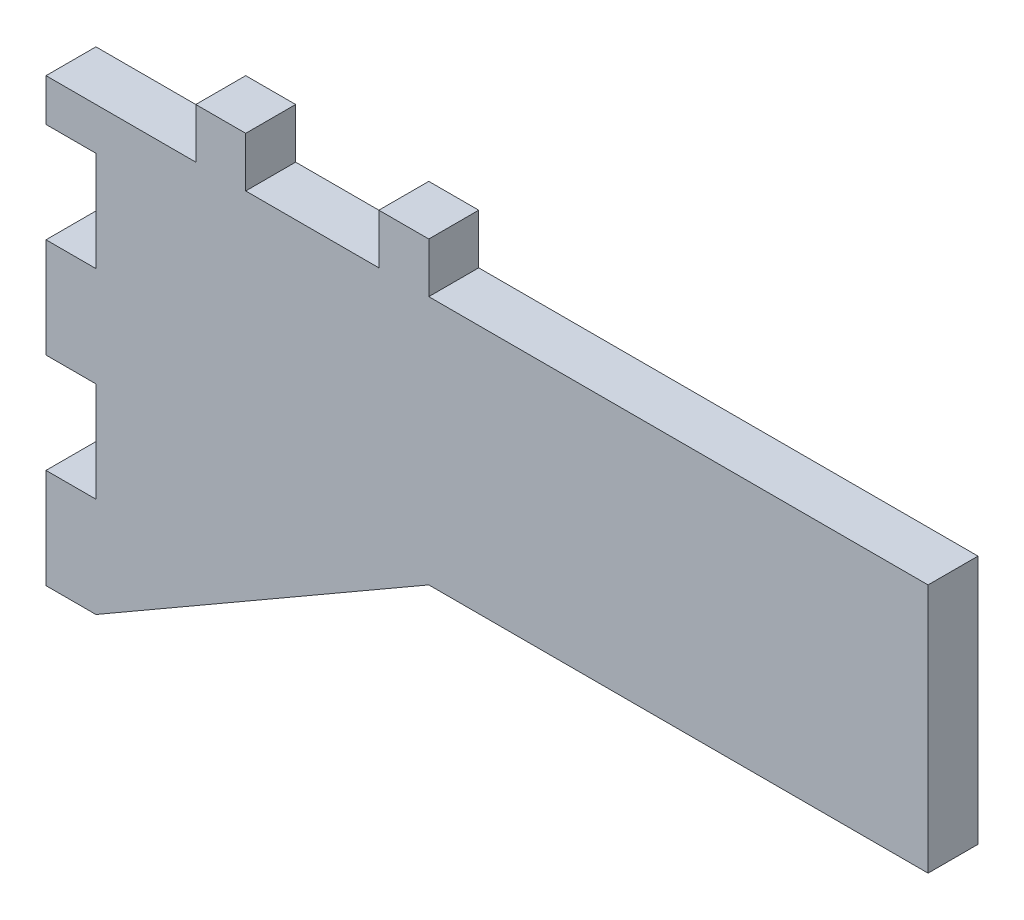
ISO-10303-21;
HEADER;
FILE_DESCRIPTION(('STEP AP214'),'2;1');
FILE_NAME('part.step','',(''),(''),'','','');
FILE_SCHEMA(('AUTOMOTIVE_DESIGN { 1 0 10303 214 1 1 1 1 }'));
ENDSEC;
DATA;
#1=APPLICATION_CONTEXT('core data for automotive mechanical design processes');
#2=APPLICATION_PROTOCOL_DEFINITION('international standard','automotive_design',2000,#1);
#3=PRODUCT_CONTEXT('',#1,'mechanical');
#4=PRODUCT('Part','Part','',(#3));
#5=PRODUCT_RELATED_PRODUCT_CATEGORY('part','',(#4));
#6=PRODUCT_DEFINITION_FORMATION('','',#4);
#7=PRODUCT_DEFINITION_CONTEXT('part definition',#1,'design');
#8=PRODUCT_DEFINITION('design','',#6,#7);
#9=PRODUCT_DEFINITION_SHAPE('','',#8);
#10=(LENGTH_UNIT() NAMED_UNIT(*) SI_UNIT(.MILLI.,.METRE.));
#11=(NAMED_UNIT(*) PLANE_ANGLE_UNIT() SI_UNIT($,.RADIAN.));
#12=(NAMED_UNIT(*) SI_UNIT($,.STERADIAN.) SOLID_ANGLE_UNIT());
#13=UNCERTAINTY_MEASURE_WITH_UNIT(LENGTH_MEASURE(1.E-05),#10,'distance_accuracy_value','');
#14=(GEOMETRIC_REPRESENTATION_CONTEXT(3) GLOBAL_UNCERTAINTY_ASSIGNED_CONTEXT((#13)) GLOBAL_UNIT_ASSIGNED_CONTEXT((#10,
#11,#12)) REPRESENTATION_CONTEXT('',''));
#15=CARTESIAN_POINT('',(0.,0.,0.));
#16=DIRECTION('',(0.,0.,1.));
#17=DIRECTION('',(1.,0.,0.));
#18=AXIS2_PLACEMENT_3D('',#15,#16,#17);
#19=CARTESIAN_POINT('',(-20.,0.,3.));
#20=DIRECTION('',(1.,0.,0.));
#21=DIRECTION('',(0.,1.,0.));
#22=AXIS2_PLACEMENT_3D('',#19,#20,#21);
#23=PLANE('',#22);
#24=DIRECTION('',(0.,0.,1.));
#25=VECTOR('',#24,1.);
#26=CARTESIAN_POINT('',(-20.,-2.54,0.));
#27=LINE('',#26,#25);
#28=CARTESIAN_POINT('',(-20.,-2.54,0.));
#29=VERTEX_POINT('',#28);
#30=CARTESIAN_POINT('',(-20.,-2.54,3.));
#31=VERTEX_POINT('',#30);
#32=EDGE_CURVE('E237',#29,#31,#27,.T.);
#33=ORIENTED_EDGE('',*,*,#32,.F.);
#34=DIRECTION('',(0.,-1.,0.));
#35=VECTOR('',#34,1.);
#36=CARTESIAN_POINT('',(-20.,0.,0.));
#37=LINE('',#36,#35);
#38=CARTESIAN_POINT('',(-20.,-8.54,0.));
#39=VERTEX_POINT('',#38);
#40=EDGE_CURVE('E374',#29,#39,#37,.T.);
#41=ORIENTED_EDGE('',*,*,#40,.T.);
#42=DIRECTION('',(0.,0.,1.));
#43=VECTOR('',#42,1.);
#44=CARTESIAN_POINT('',(-20.,-8.54,0.));
#45=LINE('',#44,#43);
#46=CARTESIAN_POINT('',(-20.,-8.54,3.));
#47=VERTEX_POINT('',#46);
#48=EDGE_CURVE('E244',#39,#47,#45,.T.);
#49=ORIENTED_EDGE('',*,*,#48,.T.);
#50=DIRECTION('',(0.,-1.,0.));
#51=VECTOR('',#50,1.);
#52=CARTESIAN_POINT('',(-20.,0.,3.));
#53=LINE('',#52,#51);
#54=EDGE_CURVE('E337',#31,#47,#53,.T.);
#55=ORIENTED_EDGE('',*,*,#54,.F.);
#56=EDGE_LOOP('',(#33,#41,#49,#55));
#57=FACE_BOUND('',#56,.T.);
#58=ADVANCED_FACE('F45',(#57),#23,.F.);
#59=DIRECTION('',(0.,0.,1.));
#60=VECTOR('',#59,1.);
#61=CARTESIAN_POINT('',(-20.,-14.54,0.));
#62=LINE('',#61,#60);
#63=CARTESIAN_POINT('',(-20.,-14.54,0.));
#64=VERTEX_POINT('',#63);
#65=CARTESIAN_POINT('',(-20.,-14.54,3.));
#66=VERTEX_POINT('',#65);
#67=EDGE_CURVE('E254',#64,#66,#62,.T.);
#68=ORIENTED_EDGE('',*,*,#67,.F.);
#69=CARTESIAN_POINT('',(-20.,-20.54,0.));
#70=VERTEX_POINT('',#69);
#71=EDGE_CURVE('E208',#64,#70,#37,.T.);
#72=ORIENTED_EDGE('',*,*,#71,.T.);
#73=DIRECTION('',(0.,0.,1.));
#74=VECTOR('',#73,1.);
#75=CARTESIAN_POINT('',(-20.,-20.54,0.));
#76=LINE('',#75,#74);
#77=CARTESIAN_POINT('',(-20.,-20.54,3.));
#78=VERTEX_POINT('',#77);
#79=EDGE_CURVE('E277',#70,#78,#76,.T.);
#80=ORIENTED_EDGE('',*,*,#79,.T.);
#81=EDGE_CURVE('E333',#66,#78,#53,.T.);
#82=ORIENTED_EDGE('',*,*,#81,.F.);
#83=EDGE_LOOP('',(#68,#72,#80,#82));
#84=FACE_BOUND('',#83,.T.);
#85=ADVANCED_FACE('F484',(#84),#23,.F.);
#86=CARTESIAN_POINT('',(0.,0.,3.));
#87=DIRECTION('',(-1.,0.,0.));
#88=DIRECTION('',(0.,0.,1.));
#89=AXIS2_PLACEMENT_3D('',#86,#87,#88);
#90=PLANE('',#89);
#91=DIRECTION('',(0.,1.,0.));
#92=VECTOR('',#91,1.);
#93=CARTESIAN_POINT('',(0.,0.,0.));
#94=LINE('',#93,#92);
#95=CARTESIAN_POINT('',(0.,0.,0.));
#96=VERTEX_POINT('',#95);
#97=CARTESIAN_POINT('',(0.,3.,0.));
#98=VERTEX_POINT('',#97);
#99=EDGE_CURVE('E241',#96,#98,#94,.T.);
#100=ORIENTED_EDGE('',*,*,#99,.T.);
#101=DIRECTION('',(0.,0.,-1.));
#102=VECTOR('',#101,1.);
#103=CARTESIAN_POINT('',(0.,3.,3.));
#104=LINE('',#103,#102);
#105=CARTESIAN_POINT('',(0.,3.,3.));
#106=VERTEX_POINT('',#105);
#107=EDGE_CURVE('E11',#106,#98,#104,.T.);
#108=ORIENTED_EDGE('',*,*,#107,.F.);
#109=DIRECTION('',(0.,1.,0.));
#110=VECTOR('',#109,1.);
#111=CARTESIAN_POINT('',(0.,0.,3.));
#112=LINE('',#111,#110);
#113=CARTESIAN_POINT('',(0.,0.,3.));
#114=VERTEX_POINT('',#113);
#115=EDGE_CURVE('E307',#114,#106,#112,.T.);
#116=ORIENTED_EDGE('',*,*,#115,.F.);
#117=DIRECTION('',(0.,0.,-1.));
#118=VECTOR('',#117,1.);
#119=CARTESIAN_POINT('',(0.,0.,3.));
#120=LINE('',#119,#118);
#121=EDGE_CURVE('E350',#114,#96,#120,.T.);
#122=ORIENTED_EDGE('',*,*,#121,.T.);
#123=EDGE_LOOP('',(#100,#108,#116,#122));
#124=FACE_BOUND('',#123,.T.);
#125=ADVANCED_FACE('F47',(#124),#90,.F.);
#126=CARTESIAN_POINT('',(0.,3.,3.));
#127=DIRECTION('',(0.,-1.,0.));
#128=DIRECTION('',(1.,0.,0.));
#129=AXIS2_PLACEMENT_3D('',#126,#127,#128);
#130=PLANE('',#129);
#131=DIRECTION('',(-1.,0.,0.));
#132=VECTOR('',#131,1.);
#133=CARTESIAN_POINT('',(0.,3.,0.));
#134=LINE('',#133,#132);
#135=CARTESIAN_POINT('',(-3.,3.,0.));
#136=VERTEX_POINT('',#135);
#137=EDGE_CURVE('E354',#98,#136,#134,.T.);
#138=ORIENTED_EDGE('',*,*,#137,.T.);
#139=DIRECTION('',(0.,0.,-1.));
#140=VECTOR('',#139,1.);
#141=CARTESIAN_POINT('',(-3.,3.,3.));
#142=LINE('',#141,#140);
#143=CARTESIAN_POINT('',(-3.,3.,3.));
#144=VERTEX_POINT('',#143);
#145=EDGE_CURVE('E54',#144,#136,#142,.T.);
#146=ORIENTED_EDGE('',*,*,#145,.F.);
#147=DIRECTION('',(-1.,0.,0.));
#148=VECTOR('',#147,1.);
#149=CARTESIAN_POINT('',(0.,3.,3.));
#150=LINE('',#149,#148);
#151=EDGE_CURVE('E311',#106,#144,#150,.T.);
#152=ORIENTED_EDGE('',*,*,#151,.F.);
#153=ORIENTED_EDGE('',*,*,#107,.T.);
#154=EDGE_LOOP('',(#138,#146,#152,#153));
#155=FACE_BOUND('',#154,.T.);
#156=ADVANCED_FACE('F448',(#155),#130,.F.);
#157=CARTESIAN_POINT('',(-3.,0.,3.));
#158=DIRECTION('',(1.,0.,0.));
#159=DIRECTION('',(0.,0.,-1.));
#160=AXIS2_PLACEMENT_3D('',#157,#158,#159);
#161=PLANE('',#160);
#162=DIRECTION('',(0.,-1.,0.));
#163=VECTOR('',#162,1.);
#164=CARTESIAN_POINT('',(-3.,0.,0.));
#165=LINE('',#164,#163);
#166=CARTESIAN_POINT('',(-3.,0.,0.));
#167=VERTEX_POINT('',#166);
#168=EDGE_CURVE('E357',#136,#167,#165,.T.);
#169=ORIENTED_EDGE('',*,*,#168,.T.);
#170=DIRECTION('',(0.,0.,-1.));
#171=VECTOR('',#170,1.);
#172=CARTESIAN_POINT('',(-3.,0.,3.));
#173=LINE('',#172,#171);
#174=CARTESIAN_POINT('',(-3.,0.,3.));
#175=VERTEX_POINT('',#174);
#176=EDGE_CURVE('E419',#175,#167,#173,.T.);
#177=ORIENTED_EDGE('',*,*,#176,.F.);
#178=DIRECTION('',(0.,-1.,0.));
#179=VECTOR('',#178,1.);
#180=CARTESIAN_POINT('',(-3.,0.,3.));
#181=LINE('',#180,#179);
#182=EDGE_CURVE('E315',#144,#175,#181,.T.);
#183=ORIENTED_EDGE('',*,*,#182,.F.);
#184=ORIENTED_EDGE('',*,*,#145,.T.);
#185=EDGE_LOOP('',(#169,#177,#183,#184));
#186=FACE_BOUND('',#185,.T.);
#187=ADVANCED_FACE('F428',(#186),#161,.F.);
#188=CARTESIAN_POINT('',(-3.,0.,3.));
#189=DIRECTION('',(0.,-1.,0.));
#190=DIRECTION('',(1.,0.,0.));
#191=AXIS2_PLACEMENT_3D('',#188,#189,#190);
#192=PLANE('',#191);
#193=DIRECTION('',(-1.,0.,0.));
#194=VECTOR('',#193,1.);
#195=CARTESIAN_POINT('',(-3.,0.,0.));
#196=LINE('',#195,#194);
#197=CARTESIAN_POINT('',(-11.,0.,0.));
#198=VERTEX_POINT('',#197);
#199=EDGE_CURVE('E360',#167,#198,#196,.T.);
#200=ORIENTED_EDGE('',*,*,#199,.T.);
#201=DIRECTION('',(0.,0.,-1.));
#202=VECTOR('',#201,1.);
#203=CARTESIAN_POINT('',(-11.,0.,3.));
#204=LINE('',#203,#202);
#205=CARTESIAN_POINT('',(-11.,0.,3.));
#206=VERTEX_POINT('',#205);
#207=EDGE_CURVE('E415',#206,#198,#204,.T.);
#208=ORIENTED_EDGE('',*,*,#207,.F.);
#209=DIRECTION('',(-1.,0.,0.));
#210=VECTOR('',#209,1.);
#211=CARTESIAN_POINT('',(-3.,0.,3.));
#212=LINE('',#211,#210);
#213=EDGE_CURVE('E318',#175,#206,#212,.T.);
#214=ORIENTED_EDGE('',*,*,#213,.F.);
#215=ORIENTED_EDGE('',*,*,#176,.T.);
#216=EDGE_LOOP('',(#200,#208,#214,#215));
#217=FACE_BOUND('',#216,.T.);
#218=ADVANCED_FACE('F436',(#217),#192,.F.);
#219=CARTESIAN_POINT('',(-11.,0.,3.));
#220=DIRECTION('',(-1.,0.,0.));
#221=DIRECTION('',(0.,0.,1.));
#222=AXIS2_PLACEMENT_3D('',#219,#220,#221);
#223=PLANE('',#222);
#224=DIRECTION('',(0.,1.,0.));
#225=VECTOR('',#224,1.);
#226=CARTESIAN_POINT('',(-11.,0.,0.));
#227=LINE('',#226,#225);
#228=CARTESIAN_POINT('',(-11.,3.,0.));
#229=VERTEX_POINT('',#228);
#230=EDGE_CURVE('E363',#198,#229,#227,.T.);
#231=ORIENTED_EDGE('',*,*,#230,.T.);
#232=DIRECTION('',(0.,0.,-1.));
#233=VECTOR('',#232,1.);
#234=CARTESIAN_POINT('',(-11.,3.,3.));
#235=LINE('',#234,#233);
#236=CARTESIAN_POINT('',(-11.,3.,3.));
#237=VERTEX_POINT('',#236);
#238=EDGE_CURVE('E411',#237,#229,#235,.T.);
#239=ORIENTED_EDGE('',*,*,#238,.F.);
#240=DIRECTION('',(0.,1.,0.));
#241=VECTOR('',#240,1.);
#242=CARTESIAN_POINT('',(-11.,0.,3.));
#243=LINE('',#242,#241);
#244=EDGE_CURVE('E321',#206,#237,#243,.T.);
#245=ORIENTED_EDGE('',*,*,#244,.F.);
#246=ORIENTED_EDGE('',*,*,#207,.T.);
#247=EDGE_LOOP('',(#231,#239,#245,#246));
#248=FACE_BOUND('',#247,.T.);
#249=ADVANCED_FACE('F440',(#248),#223,.F.);
#250=CARTESIAN_POINT('',(-11.,3.,3.));
#251=DIRECTION('',(0.,-1.,0.));
#252=DIRECTION('',(1.,0.,0.));
#253=AXIS2_PLACEMENT_3D('',#250,#251,#252);
#254=PLANE('',#253);
#255=DIRECTION('',(-1.,0.,0.));
#256=VECTOR('',#255,1.);
#257=CARTESIAN_POINT('',(-11.,3.,0.));
#258=LINE('',#257,#256);
#259=CARTESIAN_POINT('',(-14.,3.,0.));
#260=VERTEX_POINT('',#259);
#261=EDGE_CURVE('E366',#229,#260,#258,.T.);
#262=ORIENTED_EDGE('',*,*,#261,.T.);
#263=DIRECTION('',(0.,0.,-1.));
#264=VECTOR('',#263,1.);
#265=CARTESIAN_POINT('',(-14.,3.,3.));
#266=LINE('',#265,#264);
#267=CARTESIAN_POINT('',(-14.,3.,3.));
#268=VERTEX_POINT('',#267);
#269=EDGE_CURVE('E407',#268,#260,#266,.T.);
#270=ORIENTED_EDGE('',*,*,#269,.F.);
#271=DIRECTION('',(-1.,0.,0.));
#272=VECTOR('',#271,1.);
#273=CARTESIAN_POINT('',(-11.,3.,3.));
#274=LINE('',#273,#272);
#275=EDGE_CURVE('E324',#237,#268,#274,.T.);
#276=ORIENTED_EDGE('',*,*,#275,.F.);
#277=ORIENTED_EDGE('',*,*,#238,.T.);
#278=EDGE_LOOP('',(#262,#270,#276,#277));
#279=FACE_BOUND('',#278,.T.);
#280=ADVANCED_FACE('F525',(#279),#254,.F.);
#281=CARTESIAN_POINT('',(-14.,0.,3.));
#282=DIRECTION('',(1.,0.,0.));
#283=DIRECTION('',(0.,0.,-1.));
#284=AXIS2_PLACEMENT_3D('',#281,#282,#283);
#285=PLANE('',#284);
#286=DIRECTION('',(0.,-1.,0.));
#287=VECTOR('',#286,1.);
#288=CARTESIAN_POINT('',(-14.,0.,0.));
#289=LINE('',#288,#287);
#290=CARTESIAN_POINT('',(-14.,0.,0.));
#291=VERTEX_POINT('',#290);
#292=EDGE_CURVE('E209',#260,#291,#289,.T.);
#293=ORIENTED_EDGE('',*,*,#292,.T.);
#294=DIRECTION('',(0.,0.,-1.));
#295=VECTOR('',#294,1.);
#296=CARTESIAN_POINT('',(-14.,0.,3.));
#297=LINE('',#296,#295);
#298=CARTESIAN_POINT('',(-14.,0.,3.));
#299=VERTEX_POINT('',#298);
#300=EDGE_CURVE('E203',#299,#291,#297,.T.);
#301=ORIENTED_EDGE('',*,*,#300,.F.);
#302=DIRECTION('',(0.,-1.,0.));
#303=VECTOR('',#302,1.);
#304=CARTESIAN_POINT('',(-14.,0.,3.));
#305=LINE('',#304,#303);
#306=EDGE_CURVE('E327',#268,#299,#305,.T.);
#307=ORIENTED_EDGE('',*,*,#306,.F.);
#308=ORIENTED_EDGE('',*,*,#269,.T.);
#309=EDGE_LOOP('',(#293,#301,#307,#308));
#310=FACE_BOUND('',#309,.T.);
#311=ADVANCED_FACE('F522',(#310),#285,.F.);
#312=CARTESIAN_POINT('',(-14.,0.,3.));
#313=DIRECTION('',(0.,-1.,0.));
#314=DIRECTION('',(1.,0.,0.));
#315=AXIS2_PLACEMENT_3D('',#312,#313,#314);
#316=PLANE('',#315);
#317=DIRECTION('',(-1.,0.,0.));
#318=VECTOR('',#317,1.);
#319=CARTESIAN_POINT('',(-14.,0.,0.));
#320=LINE('',#319,#318);
#321=CARTESIAN_POINT('',(-23.,0.,0.));
#322=VERTEX_POINT('',#321);
#323=EDGE_CURVE('E196',#291,#322,#320,.T.);
#324=ORIENTED_EDGE('',*,*,#323,.T.);
#325=DIRECTION('',(0.,0.,1.));
#326=VECTOR('',#325,1.);
#327=CARTESIAN_POINT('',(-23.,0.,0.));
#328=LINE('',#327,#326);
#329=CARTESIAN_POINT('',(-23.,0.,3.));
#330=VERTEX_POINT('',#329);
#331=EDGE_CURVE('E200',#322,#330,#328,.T.);
#332=ORIENTED_EDGE('',*,*,#331,.T.);
#333=DIRECTION('',(-1.,0.,0.));
#334=VECTOR('',#333,1.);
#335=CARTESIAN_POINT('',(-14.,0.,3.));
#336=LINE('',#335,#334);
#337=EDGE_CURVE('E330',#299,#330,#336,.T.);
#338=ORIENTED_EDGE('',*,*,#337,.F.);
#339=ORIENTED_EDGE('',*,*,#300,.T.);
#340=EDGE_LOOP('',(#324,#332,#338,#339));
#341=FACE_BOUND('',#340,.T.);
#342=ADVANCED_FACE('F198',(#341),#316,.F.);
#343=CARTESIAN_POINT('',(-20.,-26.54,3.));
#344=DIRECTION('',(-0.499772441725888,0.866156744758905,0.));
#345=DIRECTION('',(-0.866156744758905,-0.499772441725888,0.));
#346=AXIS2_PLACEMENT_3D('',#343,#344,#345);
#347=PLANE('',#346);
#348=DIRECTION('',(0.866156744758905,0.499772441725888,0.));
#349=VECTOR('',#348,1.);
#350=CARTESIAN_POINT('',(-20.,-26.54,0.));
#351=LINE('',#350,#349);
#352=CARTESIAN_POINT('',(-20.,-26.54,0.));
#353=VERTEX_POINT('',#352);
#354=CARTESIAN_POINT('',(0.,-15.,0.));
#355=VERTEX_POINT('',#354);
#356=EDGE_CURVE('E375',#353,#355,#351,.T.);
#357=ORIENTED_EDGE('',*,*,#356,.T.);
#358=DIRECTION('',(0.,0.,-1.));
#359=VECTOR('',#358,1.);
#360=CARTESIAN_POINT('',(0.,-15.,3.));
#361=LINE('',#360,#359);
#362=CARTESIAN_POINT('',(0.,-15.,3.));
#363=VERTEX_POINT('',#362);
#364=EDGE_CURVE('E397',#363,#355,#361,.T.);
#365=ORIENTED_EDGE('',*,*,#364,.F.);
#366=DIRECTION('',(0.866156744758905,0.499772441725888,0.));
#367=VECTOR('',#366,1.);
#368=CARTESIAN_POINT('',(-20.,-26.54,3.));
#369=LINE('',#368,#367);
#370=CARTESIAN_POINT('',(-20.,-26.54,3.));
#371=VERTEX_POINT('',#370);
#372=EDGE_CURVE('E338',#371,#363,#369,.T.);
#373=ORIENTED_EDGE('',*,*,#372,.F.);
#374=DIRECTION('',(0.,0.,-1.));
#375=VECTOR('',#374,1.);
#376=CARTESIAN_POINT('',(-20.,-26.54,3.));
#377=LINE('',#376,#375);
#378=EDGE_CURVE('E401',#371,#353,#377,.T.);
#379=ORIENTED_EDGE('',*,*,#378,.T.);
#380=EDGE_LOOP('',(#357,#365,#373,#379));
#381=FACE_BOUND('',#380,.T.);
#382=ADVANCED_FACE('F470',(#381),#347,.F.);
#383=CARTESIAN_POINT('',(0.,-15.,3.));
#384=DIRECTION('',(0.,1.,0.));
#385=DIRECTION('',(0.,0.,1.));
#386=AXIS2_PLACEMENT_3D('',#383,#384,#385);
#387=PLANE('',#386);
#388=DIRECTION('',(1.,0.,0.));
#389=VECTOR('',#388,1.);
#390=CARTESIAN_POINT('',(0.,-15.,0.));
#391=LINE('',#390,#389);
#392=CARTESIAN_POINT('',(30.,-15.,0.));
#393=VERTEX_POINT('',#392);
#394=EDGE_CURVE('E378',#355,#393,#391,.T.);
#395=ORIENTED_EDGE('',*,*,#394,.T.);
#396=DIRECTION('',(0.,0.,-1.));
#397=VECTOR('',#396,1.);
#398=CARTESIAN_POINT('',(30.,-15.,3.));
#399=LINE('',#398,#397);
#400=CARTESIAN_POINT('',(30.,-15.,3.));
#401=VERTEX_POINT('',#400);
#402=EDGE_CURVE('E393',#401,#393,#399,.T.);
#403=ORIENTED_EDGE('',*,*,#402,.F.);
#404=DIRECTION('',(1.,0.,0.));
#405=VECTOR('',#404,1.);
#406=CARTESIAN_POINT('',(0.,-15.,3.));
#407=LINE('',#406,#405);
#408=EDGE_CURVE('E341',#363,#401,#407,.T.);
#409=ORIENTED_EDGE('',*,*,#408,.F.);
#410=ORIENTED_EDGE('',*,*,#364,.T.);
#411=EDGE_LOOP('',(#395,#403,#409,#410));
#412=FACE_BOUND('',#411,.T.);
#413=ADVANCED_FACE('F464',(#412),#387,.F.);
#414=CARTESIAN_POINT('',(30.,0.,3.));
#415=DIRECTION('',(-1.,0.,0.));
#416=DIRECTION('',(0.,-1.,0.));
#417=AXIS2_PLACEMENT_3D('',#414,#415,#416);
#418=PLANE('',#417);
#419=DIRECTION('',(0.,1.,0.));
#420=VECTOR('',#419,1.);
#421=CARTESIAN_POINT('',(30.,0.,0.));
#422=LINE('',#421,#420);
#423=CARTESIAN_POINT('',(30.,0.,0.));
#424=VERTEX_POINT('',#423);
#425=EDGE_CURVE('E381',#393,#424,#422,.T.);
#426=ORIENTED_EDGE('',*,*,#425,.T.);
#427=DIRECTION('',(0.,0.,-1.));
#428=VECTOR('',#427,1.);
#429=CARTESIAN_POINT('',(30.,0.,3.));
#430=LINE('',#429,#428);
#431=CARTESIAN_POINT('',(30.,0.,3.));
#432=VERTEX_POINT('',#431);
#433=EDGE_CURVE('E389',#432,#424,#430,.T.);
#434=ORIENTED_EDGE('',*,*,#433,.F.);
#435=DIRECTION('',(0.,1.,0.));
#436=VECTOR('',#435,1.);
#437=CARTESIAN_POINT('',(30.,0.,3.));
#438=LINE('',#437,#436);
#439=EDGE_CURVE('E344',#401,#432,#438,.T.);
#440=ORIENTED_EDGE('',*,*,#439,.F.);
#441=ORIENTED_EDGE('',*,*,#402,.T.);
#442=EDGE_LOOP('',(#426,#434,#440,#441));
#443=FACE_BOUND('',#442,.T.);
#444=ADVANCED_FACE('F460',(#443),#418,.F.);
#445=CARTESIAN_POINT('',(0.,0.,3.));
#446=DIRECTION('',(0.,-1.,0.));
#447=DIRECTION('',(0.,0.,-1.));
#448=AXIS2_PLACEMENT_3D('',#445,#446,#447);
#449=PLANE('',#448);
#450=DIRECTION('',(-1.,0.,0.));
#451=VECTOR('',#450,1.);
#452=CARTESIAN_POINT('',(0.,0.,0.));
#453=LINE('',#452,#451);
#454=EDGE_CURVE('E312',#424,#96,#453,.T.);
#455=ORIENTED_EDGE('',*,*,#454,.T.);
#456=ORIENTED_EDGE('',*,*,#121,.F.);
#457=DIRECTION('',(-1.,0.,0.));
#458=VECTOR('',#457,1.);
#459=CARTESIAN_POINT('',(0.,0.,3.));
#460=LINE('',#459,#458);
#461=EDGE_CURVE('E347',#432,#114,#460,.T.);
#462=ORIENTED_EDGE('',*,*,#461,.F.);
#463=ORIENTED_EDGE('',*,*,#433,.T.);
#464=EDGE_LOOP('',(#455,#456,#462,#463));
#465=FACE_BOUND('',#464,.T.);
#466=ADVANCED_FACE('F455',(#465),#449,.F.);
#467=CARTESIAN_POINT('',(0.,0.,3.));
#468=DIRECTION('',(0.,0.,1.));
#469=DIRECTION('',(1.,0.,0.));
#470=AXIS2_PLACEMENT_3D('',#467,#468,#469);
#471=PLANE('',#470);
#472=ORIENTED_EDGE('',*,*,#115,.T.);
#473=ORIENTED_EDGE('',*,*,#151,.T.);
#474=ORIENTED_EDGE('',*,*,#182,.T.);
#475=ORIENTED_EDGE('',*,*,#213,.T.);
#476=ORIENTED_EDGE('',*,*,#244,.T.);
#477=ORIENTED_EDGE('',*,*,#275,.T.);
#478=ORIENTED_EDGE('',*,*,#306,.T.);
#479=ORIENTED_EDGE('',*,*,#337,.T.);
#480=DIRECTION('',(0.,-1.,0.));
#481=VECTOR('',#480,1.);
#482=CARTESIAN_POINT('',(-23.,0.,3.));
#483=LINE('',#482,#481);
#484=CARTESIAN_POINT('',(-23.,-2.54,3.));
#485=VERTEX_POINT('',#484);
#486=EDGE_CURVE('E217',#330,#485,#483,.T.);
#487=ORIENTED_EDGE('',*,*,#486,.T.);
#488=DIRECTION('',(1.,0.,0.));
#489=VECTOR('',#488,1.);
#490=CARTESIAN_POINT('',(-20.,-2.54,3.));
#491=LINE('',#490,#489);
#492=EDGE_CURVE('E227',#485,#31,#491,.T.);
#493=ORIENTED_EDGE('',*,*,#492,.T.);
#494=ORIENTED_EDGE('',*,*,#54,.T.);
#495=DIRECTION('',(-1.,0.,0.));
#496=VECTOR('',#495,1.);
#497=CARTESIAN_POINT('',(-20.,-8.54,3.));
#498=LINE('',#497,#496);
#499=CARTESIAN_POINT('',(-23.,-8.54,3.));
#500=VERTEX_POINT('',#499);
#501=EDGE_CURVE('E69',#47,#500,#498,.T.);
#502=ORIENTED_EDGE('',*,*,#501,.T.);
#503=DIRECTION('',(0.,-1.,0.));
#504=VECTOR('',#503,1.);
#505=CARTESIAN_POINT('',(-23.,-8.54,3.));
#506=LINE('',#505,#504);
#507=CARTESIAN_POINT('',(-23.,-14.54,3.));
#508=VERTEX_POINT('',#507);
#509=EDGE_CURVE('E261',#500,#508,#506,.T.);
#510=ORIENTED_EDGE('',*,*,#509,.T.);
#511=DIRECTION('',(1.,0.,0.));
#512=VECTOR('',#511,1.);
#513=CARTESIAN_POINT('',(-20.,-14.54,3.));
#514=LINE('',#513,#512);
#515=EDGE_CURVE('E257',#508,#66,#514,.T.);
#516=ORIENTED_EDGE('',*,*,#515,.T.);
#517=ORIENTED_EDGE('',*,*,#81,.T.);
#518=DIRECTION('',(-1.,0.,0.));
#519=VECTOR('',#518,1.);
#520=CARTESIAN_POINT('',(-20.,-20.54,3.));
#521=LINE('',#520,#519);
#522=CARTESIAN_POINT('',(-23.,-20.54,3.));
#523=VERTEX_POINT('',#522);
#524=EDGE_CURVE('E61',#78,#523,#521,.T.);
#525=ORIENTED_EDGE('',*,*,#524,.T.);
#526=DIRECTION('',(0.,-1.,0.));
#527=VECTOR('',#526,1.);
#528=CARTESIAN_POINT('',(-23.,-20.54,3.));
#529=LINE('',#528,#527);
#530=CARTESIAN_POINT('',(-23.,-26.54,3.));
#531=VERTEX_POINT('',#530);
#532=EDGE_CURVE('E291',#523,#531,#529,.T.);
#533=ORIENTED_EDGE('',*,*,#532,.T.);
#534=DIRECTION('',(1.,0.,0.));
#535=VECTOR('',#534,1.);
#536=CARTESIAN_POINT('',(-20.,-26.54,3.));
#537=LINE('',#536,#535);
#538=EDGE_CURVE('E287',#531,#371,#537,.T.);
#539=ORIENTED_EDGE('',*,*,#538,.T.);
#540=ORIENTED_EDGE('',*,*,#372,.T.);
#541=ORIENTED_EDGE('',*,*,#408,.T.);
#542=ORIENTED_EDGE('',*,*,#439,.T.);
#543=ORIENTED_EDGE('',*,*,#461,.T.);
#544=EDGE_LOOP('',(#472,#473,#474,#475,#476,#477,#478,#479,#487,#493,#494,#502,#510,#516,#517,
#525,#533,#539,#540,#541,#542,#543));
#545=FACE_BOUND('',#544,.T.);
#546=ADVANCED_FACE('F444',(#545),#471,.T.);
#547=CARTESIAN_POINT('',(0.,0.,0.));
#548=DIRECTION('',(0.,0.,1.));
#549=DIRECTION('',(1.,0.,0.));
#550=AXIS2_PLACEMENT_3D('',#547,#548,#549);
#551=PLANE('',#550);
#552=ORIENTED_EDGE('',*,*,#99,.F.);
#553=ORIENTED_EDGE('',*,*,#454,.F.);
#554=ORIENTED_EDGE('',*,*,#425,.F.);
#555=ORIENTED_EDGE('',*,*,#394,.F.);
#556=ORIENTED_EDGE('',*,*,#356,.F.);
#557=DIRECTION('',(1.,0.,0.));
#558=VECTOR('',#557,1.);
#559=CARTESIAN_POINT('',(-20.,-26.54,0.));
#560=LINE('',#559,#558);
#561=CARTESIAN_POINT('',(-23.,-26.54,0.));
#562=VERTEX_POINT('',#561);
#563=EDGE_CURVE('E280',#562,#353,#560,.T.);
#564=ORIENTED_EDGE('',*,*,#563,.F.);
#565=DIRECTION('',(0.,-1.,0.));
#566=VECTOR('',#565,1.);
#567=CARTESIAN_POINT('',(-23.,-20.54,0.));
#568=LINE('',#567,#566);
#569=CARTESIAN_POINT('',(-23.,-20.54,0.));
#570=VERTEX_POINT('',#569);
#571=EDGE_CURVE('E300',#570,#562,#568,.T.);
#572=ORIENTED_EDGE('',*,*,#571,.F.);
#573=DIRECTION('',(-1.,0.,0.));
#574=VECTOR('',#573,1.);
#575=CARTESIAN_POINT('',(-20.,-20.54,0.));
#576=LINE('',#575,#574);
#577=EDGE_CURVE('E292',#70,#570,#576,.T.);
#578=ORIENTED_EDGE('',*,*,#577,.F.);
#579=ORIENTED_EDGE('',*,*,#71,.F.);
#580=DIRECTION('',(1.,0.,0.));
#581=VECTOR('',#580,1.);
#582=CARTESIAN_POINT('',(-20.,-14.54,0.));
#583=LINE('',#582,#581);
#584=CARTESIAN_POINT('',(-23.,-14.54,0.));
#585=VERTEX_POINT('',#584);
#586=EDGE_CURVE('E247',#585,#64,#583,.T.);
#587=ORIENTED_EDGE('',*,*,#586,.F.);
#588=DIRECTION('',(0.,-1.,0.));
#589=VECTOR('',#588,1.);
#590=CARTESIAN_POINT('',(-23.,-8.54,0.));
#591=LINE('',#590,#589);
#592=CARTESIAN_POINT('',(-23.,-8.54,0.));
#593=VERTEX_POINT('',#592);
#594=EDGE_CURVE('E270',#593,#585,#591,.T.);
#595=ORIENTED_EDGE('',*,*,#594,.F.);
#596=DIRECTION('',(-1.,0.,0.));
#597=VECTOR('',#596,1.);
#598=CARTESIAN_POINT('',(-20.,-8.54,0.));
#599=LINE('',#598,#597);
#600=EDGE_CURVE('E262',#39,#593,#599,.T.);
#601=ORIENTED_EDGE('',*,*,#600,.F.);
#602=ORIENTED_EDGE('',*,*,#40,.F.);
#603=DIRECTION('',(1.,0.,0.));
#604=VECTOR('',#603,1.);
#605=CARTESIAN_POINT('',(-20.,-2.54,0.));
#606=LINE('',#605,#604);
#607=CARTESIAN_POINT('',(-23.,-2.54,0.));
#608=VERTEX_POINT('',#607);
#609=EDGE_CURVE('E220',#608,#29,#606,.T.);
#610=ORIENTED_EDGE('',*,*,#609,.F.);
#611=DIRECTION('',(0.,-1.,0.));
#612=VECTOR('',#611,1.);
#613=CARTESIAN_POINT('',(-23.,0.,0.));
#614=LINE('',#613,#612);
#615=EDGE_CURVE('E214',#322,#608,#614,.T.);
#616=ORIENTED_EDGE('',*,*,#615,.F.);
#617=ORIENTED_EDGE('',*,*,#323,.F.);
#618=ORIENTED_EDGE('',*,*,#292,.F.);
#619=ORIENTED_EDGE('',*,*,#261,.F.);
#620=ORIENTED_EDGE('',*,*,#230,.F.);
#621=ORIENTED_EDGE('',*,*,#199,.F.);
#622=ORIENTED_EDGE('',*,*,#168,.F.);
#623=ORIENTED_EDGE('',*,*,#137,.F.);
#624=EDGE_LOOP('',(#552,#553,#554,#555,#556,#564,#572,#578,#579,#587,#595,#601,#602,#610,#616,
#617,#618,#619,#620,#621,#622,#623));
#625=FACE_BOUND('',#624,.T.);
#626=ADVANCED_FACE('F223',(#625),#551,.F.);
#627=CARTESIAN_POINT('',(-20.,-26.54,0.));
#628=DIRECTION('',(0.,-1.,0.));
#629=DIRECTION('',(0.,0.,-1.));
#630=AXIS2_PLACEMENT_3D('',#627,#628,#629);
#631=PLANE('',#630);
#632=ORIENTED_EDGE('',*,*,#538,.F.);
#633=DIRECTION('',(0.,0.,1.));
#634=VECTOR('',#633,1.);
#635=CARTESIAN_POINT('',(-23.,-26.54,0.));
#636=LINE('',#635,#634);
#637=EDGE_CURVE('E284',#562,#531,#636,.T.);
#638=ORIENTED_EDGE('',*,*,#637,.F.);
#639=ORIENTED_EDGE('',*,*,#563,.T.);
#640=ORIENTED_EDGE('',*,*,#378,.F.);
#641=EDGE_LOOP('',(#632,#638,#639,#640));
#642=FACE_BOUND('',#641,.T.);
#643=ADVANCED_FACE('F474',(#642),#631,.T.);
#644=CARTESIAN_POINT('',(-23.,-20.54,0.));
#645=DIRECTION('',(-1.,0.,0.));
#646=DIRECTION('',(0.,0.,1.));
#647=AXIS2_PLACEMENT_3D('',#644,#645,#646);
#648=PLANE('',#647);
#649=ORIENTED_EDGE('',*,*,#532,.F.);
#650=DIRECTION('',(0.,0.,1.));
#651=VECTOR('',#650,1.);
#652=CARTESIAN_POINT('',(-23.,-20.54,0.));
#653=LINE('',#652,#651);
#654=EDGE_CURVE('E281',#570,#523,#653,.T.);
#655=ORIENTED_EDGE('',*,*,#654,.F.);
#656=ORIENTED_EDGE('',*,*,#571,.T.);
#657=ORIENTED_EDGE('',*,*,#637,.T.);
#658=EDGE_LOOP('',(#649,#655,#656,#657));
#659=FACE_BOUND('',#658,.T.);
#660=ADVANCED_FACE('F477',(#659),#648,.T.);
#661=CARTESIAN_POINT('',(-20.,-20.54,0.));
#662=DIRECTION('',(0.,1.,0.));
#663=DIRECTION('',(0.,0.,1.));
#664=AXIS2_PLACEMENT_3D('',#661,#662,#663);
#665=PLANE('',#664);
#666=ORIENTED_EDGE('',*,*,#524,.F.);
#667=ORIENTED_EDGE('',*,*,#79,.F.);
#668=ORIENTED_EDGE('',*,*,#577,.T.);
#669=ORIENTED_EDGE('',*,*,#654,.T.);
#670=EDGE_LOOP('',(#666,#667,#668,#669));
#671=FACE_BOUND('',#670,.T.);
#672=ADVANCED_FACE('F480',(#671),#665,.T.);
#673=CARTESIAN_POINT('',(-20.,-14.54,0.));
#674=DIRECTION('',(0.,-1.,0.));
#675=DIRECTION('',(0.,0.,-1.));
#676=AXIS2_PLACEMENT_3D('',#673,#674,#675);
#677=PLANE('',#676);
#678=ORIENTED_EDGE('',*,*,#515,.F.);
#679=DIRECTION('',(0.,0.,1.));
#680=VECTOR('',#679,1.);
#681=CARTESIAN_POINT('',(-23.,-14.54,0.));
#682=LINE('',#681,#680);
#683=EDGE_CURVE('E251',#585,#508,#682,.T.);
#684=ORIENTED_EDGE('',*,*,#683,.F.);
#685=ORIENTED_EDGE('',*,*,#586,.T.);
#686=ORIENTED_EDGE('',*,*,#67,.T.);
#687=EDGE_LOOP('',(#678,#684,#685,#686));
#688=FACE_BOUND('',#687,.T.);
#689=ADVANCED_FACE('F488',(#688),#677,.T.);
#690=CARTESIAN_POINT('',(-23.,-8.54,0.));
#691=DIRECTION('',(-1.,0.,0.));
#692=DIRECTION('',(0.,0.,1.));
#693=AXIS2_PLACEMENT_3D('',#690,#691,#692);
#694=PLANE('',#693);
#695=ORIENTED_EDGE('',*,*,#509,.F.);
#696=DIRECTION('',(0.,0.,1.));
#697=VECTOR('',#696,1.);
#698=CARTESIAN_POINT('',(-23.,-8.54,0.));
#699=LINE('',#698,#697);
#700=EDGE_CURVE('E248',#593,#500,#699,.T.);
#701=ORIENTED_EDGE('',*,*,#700,.F.);
#702=ORIENTED_EDGE('',*,*,#594,.T.);
#703=ORIENTED_EDGE('',*,*,#683,.T.);
#704=EDGE_LOOP('',(#695,#701,#702,#703));
#705=FACE_BOUND('',#704,.T.);
#706=ADVANCED_FACE('F509',(#705),#694,.T.);
#707=CARTESIAN_POINT('',(-20.,-8.54,0.));
#708=DIRECTION('',(0.,1.,0.));
#709=DIRECTION('',(0.,0.,1.));
#710=AXIS2_PLACEMENT_3D('',#707,#708,#709);
#711=PLANE('',#710);
#712=ORIENTED_EDGE('',*,*,#501,.F.);
#713=ORIENTED_EDGE('',*,*,#48,.F.);
#714=ORIENTED_EDGE('',*,*,#600,.T.);
#715=ORIENTED_EDGE('',*,*,#700,.T.);
#716=EDGE_LOOP('',(#712,#713,#714,#715));
#717=FACE_BOUND('',#716,.T.);
#718=ADVANCED_FACE('F494',(#717),#711,.T.);
#719=CARTESIAN_POINT('',(-20.,-2.54,0.));
#720=DIRECTION('',(0.,-1.,0.));
#721=DIRECTION('',(1.,0.,0.));
#722=AXIS2_PLACEMENT_3D('',#719,#720,#721);
#723=PLANE('',#722);
#724=ORIENTED_EDGE('',*,*,#492,.F.);
#725=DIRECTION('',(0.,0.,1.));
#726=VECTOR('',#725,1.);
#727=CARTESIAN_POINT('',(-23.,-2.54,0.));
#728=LINE('',#727,#726);
#729=EDGE_CURVE('E219',#608,#485,#728,.T.);
#730=ORIENTED_EDGE('',*,*,#729,.F.);
#731=ORIENTED_EDGE('',*,*,#609,.T.);
#732=ORIENTED_EDGE('',*,*,#32,.T.);
#733=EDGE_LOOP('',(#724,#730,#731,#732));
#734=FACE_BOUND('',#733,.T.);
#735=ADVANCED_FACE('F501',(#734),#723,.T.);
#736=CARTESIAN_POINT('',(-23.,0.,0.));
#737=DIRECTION('',(-1.,0.,0.));
#738=DIRECTION('',(0.,0.,1.));
#739=AXIS2_PLACEMENT_3D('',#736,#737,#738);
#740=PLANE('',#739);
#741=ORIENTED_EDGE('',*,*,#486,.F.);
#742=ORIENTED_EDGE('',*,*,#331,.F.);
#743=ORIENTED_EDGE('',*,*,#615,.T.);
#744=ORIENTED_EDGE('',*,*,#729,.T.);
#745=EDGE_LOOP('',(#741,#742,#743,#744));
#746=FACE_BOUND('',#745,.T.);
#747=ADVANCED_FACE('F213',(#746),#740,.T.);
#748=CLOSED_SHELL('',(#58,#85,#125,#156,#187,#218,#249,#280,#311,#342,#382,#413,#444,#466,#546,
#626,#643,#660,#672,#689,#706,#718,#735,#747));
#749=MANIFOLD_SOLID_BREP('B2',#748);
#750=ADVANCED_BREP_SHAPE_REPRESENTATION('',(#18,#749),#14);
#751=SHAPE_DEFINITION_REPRESENTATION(#9,#750);
ENDSEC;
END-ISO-10303-21;
